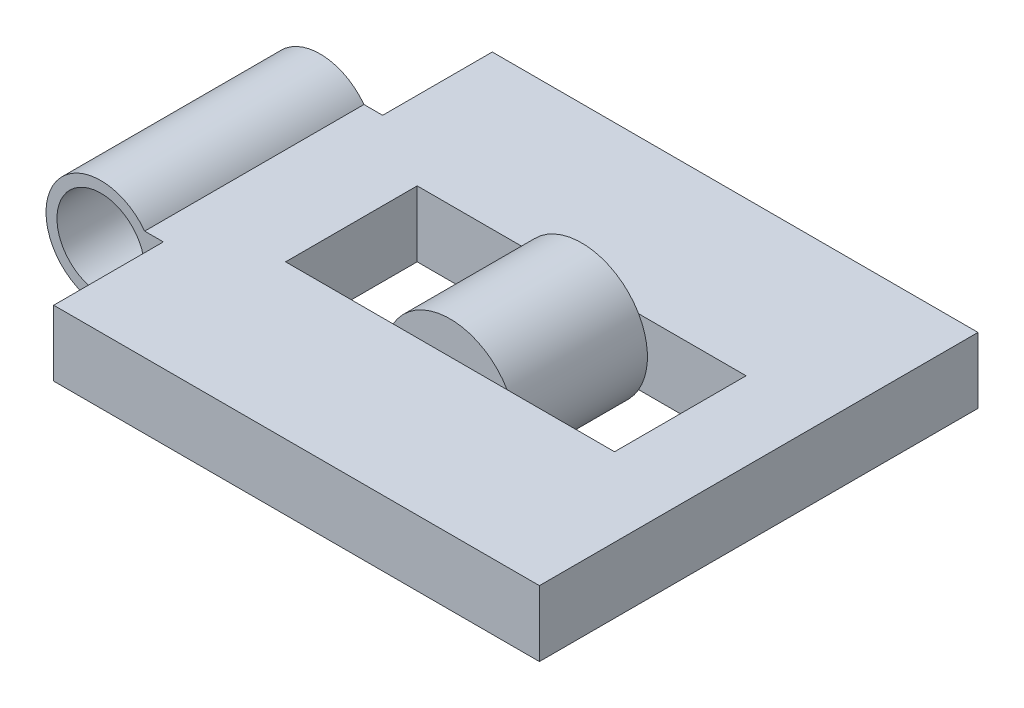
ISO-10303-21;
HEADER;
FILE_DESCRIPTION(('STEP AP214'),'2;1');
FILE_NAME('part.step','',(''),(''),'','','');
FILE_SCHEMA(('AUTOMOTIVE_DESIGN { 1 0 10303 214 1 1 1 1 }'));
ENDSEC;
DATA;
#1=APPLICATION_CONTEXT('core data for automotive mechanical design processes');
#2=APPLICATION_PROTOCOL_DEFINITION('international standard','automotive_design',2000,#1);
#3=PRODUCT_CONTEXT('',#1,'mechanical');
#4=PRODUCT('Part','Part','',(#3));
#5=PRODUCT_RELATED_PRODUCT_CATEGORY('part','',(#4));
#6=PRODUCT_DEFINITION_FORMATION('','',#4);
#7=PRODUCT_DEFINITION_CONTEXT('part definition',#1,'design');
#8=PRODUCT_DEFINITION('design','',#6,#7);
#9=PRODUCT_DEFINITION_SHAPE('','',#8);
#10=(LENGTH_UNIT() NAMED_UNIT(*) SI_UNIT(.MILLI.,.METRE.));
#11=(NAMED_UNIT(*) PLANE_ANGLE_UNIT() SI_UNIT($,.RADIAN.));
#12=(NAMED_UNIT(*) SI_UNIT($,.STERADIAN.) SOLID_ANGLE_UNIT());
#13=UNCERTAINTY_MEASURE_WITH_UNIT(LENGTH_MEASURE(1.E-05),#10,'distance_accuracy_value','');
#14=(GEOMETRIC_REPRESENTATION_CONTEXT(3) GLOBAL_UNCERTAINTY_ASSIGNED_CONTEXT((#13)) GLOBAL_UNIT_ASSIGNED_CONTEXT((#10,
#11,#12)) REPRESENTATION_CONTEXT('',''));
#15=CARTESIAN_POINT('',(0.,0.,0.));
#16=DIRECTION('',(0.,0.,1.));
#17=DIRECTION('',(1.,0.,0.));
#18=AXIS2_PLACEMENT_3D('',#15,#16,#17);
#19=CARTESIAN_POINT('',(108.842352038613,12.7,66.04));
#20=DIRECTION('',(0.,0.,1.));
#21=DIRECTION('',(1.,0.,0.));
#22=AXIS2_PLACEMENT_3D('',#19,#20,#21);
#23=PLANE('',#22);
#24=CARTESIAN_POINT('',(70.7423520386134,0.,66.04));
#25=DIRECTION('',(0.,0.,1.));
#26=DIRECTION('',(1.,0.,0.));
#27=AXIS2_PLACEMENT_3D('',#24,#25,#26);
#28=CIRCLE('',#27,15.24);
#29=CARTESIAN_POINT('',(57.5441248849386,7.62,66.04));
#30=VERTEX_POINT('',#29);
#31=CARTESIAN_POINT('',(57.5441248849386,-7.62,66.04));
#32=VERTEX_POINT('',#31);
#33=EDGE_CURVE('E452',#30,#32,#28,.T.);
#34=ORIENTED_EDGE('',*,*,#33,.T.);
#35=DIRECTION('',(-1.,0.,0.));
#36=VECTOR('',#35,1.);
#37=CARTESIAN_POINT('',(108.842352038613,-7.62,66.04));
#38=LINE('',#37,#36);
#39=CARTESIAN_POINT('',(32.6423520386134,-7.62,66.04));
#40=VERTEX_POINT('',#39);
#41=EDGE_CURVE('E461',#32,#40,#38,.T.);
#42=ORIENTED_EDGE('',*,*,#41,.T.);
#43=DIRECTION('',(0.,-1.,0.));
#44=VECTOR('',#43,1.);
#45=CARTESIAN_POINT('',(32.6423520386134,12.7,66.04));
#46=LINE('',#45,#44);
#47=CARTESIAN_POINT('',(32.6423520386134,7.62,66.04));
#48=VERTEX_POINT('',#47);
#49=EDGE_CURVE('E464',#48,#40,#46,.T.);
#50=ORIENTED_EDGE('',*,*,#49,.F.);
#51=DIRECTION('',(-1.,0.,0.));
#52=VECTOR('',#51,1.);
#53=CARTESIAN_POINT('',(0.,7.62,66.04));
#54=LINE('',#53,#52);
#55=EDGE_CURVE('E50',#30,#48,#54,.T.);
#56=ORIENTED_EDGE('',*,*,#55,.F.);
#57=EDGE_LOOP('',(#34,#42,#50,#56));
#58=FACE_BOUND('',#57,.T.);
#59=ADVANCED_FACE('F35',(#58),#23,.F.);
#60=CARTESIAN_POINT('',(108.842352038613,12.7,35.56));
#61=DIRECTION('',(0.,0.,-1.));
#62=DIRECTION('',(-1.,0.,0.));
#63=AXIS2_PLACEMENT_3D('',#60,#61,#62);
#64=PLANE('',#63);
#65=CARTESIAN_POINT('',(70.7423520386134,0.,35.56));
#66=DIRECTION('',(0.,0.,-1.));
#67=DIRECTION('',(-1.,0.,0.));
#68=AXIS2_PLACEMENT_3D('',#65,#66,#67);
#69=CIRCLE('',#68,15.24);
#70=CARTESIAN_POINT('',(83.9405791922882,-7.62,35.56));
#71=VERTEX_POINT('',#70);
#72=CARTESIAN_POINT('',(83.9405791922882,7.62,35.56));
#73=VERTEX_POINT('',#72);
#74=EDGE_CURVE('E11',#71,#73,#69,.F.);
#75=ORIENTED_EDGE('',*,*,#74,.F.);
#76=DIRECTION('',(1.,0.,0.));
#77=VECTOR('',#76,1.);
#78=CARTESIAN_POINT('',(108.842352038613,-7.62,35.56));
#79=LINE('',#78,#77);
#80=CARTESIAN_POINT('',(108.842352038613,-7.62,35.56));
#81=VERTEX_POINT('',#80);
#82=EDGE_CURVE('E160',#71,#81,#79,.T.);
#83=ORIENTED_EDGE('',*,*,#82,.T.);
#84=DIRECTION('',(0.,-1.,0.));
#85=VECTOR('',#84,1.);
#86=CARTESIAN_POINT('',(108.842352038613,12.7,35.56));
#87=LINE('',#86,#85);
#88=CARTESIAN_POINT('',(108.842352038613,7.62,35.56));
#89=VERTEX_POINT('',#88);
#90=EDGE_CURVE('E469',#89,#81,#87,.T.);
#91=ORIENTED_EDGE('',*,*,#90,.F.);
#92=DIRECTION('',(1.,0.,0.));
#93=VECTOR('',#92,1.);
#94=CARTESIAN_POINT('',(0.,7.62,35.56));
#95=LINE('',#94,#93);
#96=EDGE_CURVE('E466',#73,#89,#95,.T.);
#97=ORIENTED_EDGE('',*,*,#96,.F.);
#98=EDGE_LOOP('',(#75,#83,#91,#97));
#99=FACE_BOUND('',#98,.T.);
#100=ADVANCED_FACE('F297',(#99),#64,.F.);
#101=CARTESIAN_POINT('',(0.,7.62,101.6));
#102=DIRECTION('',(0.,-1.,0.));
#103=DIRECTION('',(0.,0.,-1.));
#104=AXIS2_PLACEMENT_3D('',#101,#102,#103);
#105=PLANE('',#104);
#106=CARTESIAN_POINT('',(108.842352038613,7.62,66.04));
#107=VERTEX_POINT('',#106);
#108=CARTESIAN_POINT('',(83.9405791922882,7.62,66.04));
#109=VERTEX_POINT('',#108);
#110=EDGE_CURVE('E478',#107,#109,#54,.T.);
#111=ORIENTED_EDGE('',*,*,#110,.T.);
#112=EDGE_CURVE('E479',#109,#30,#54,.T.);
#113=ORIENTED_EDGE('',*,*,#112,.T.);
#114=ORIENTED_EDGE('',*,*,#55,.T.);
#115=DIRECTION('',(0.,0.,-1.));
#116=VECTOR('',#115,1.);
#117=CARTESIAN_POINT('',(32.6423520386134,7.62,101.6));
#118=LINE('',#117,#116);
#119=CARTESIAN_POINT('',(32.6423520386134,7.62,35.56));
#120=VERTEX_POINT('',#119);
#121=EDGE_CURVE('E260',#48,#120,#118,.T.);
#122=ORIENTED_EDGE('',*,*,#121,.T.);
#123=CARTESIAN_POINT('',(57.5441248849386,7.62,35.56));
#124=VERTEX_POINT('',#123);
#125=EDGE_CURVE('E473',#120,#124,#95,.T.);
#126=ORIENTED_EDGE('',*,*,#125,.T.);
#127=EDGE_CURVE('E476',#124,#73,#95,.T.);
#128=ORIENTED_EDGE('',*,*,#127,.T.);
#129=ORIENTED_EDGE('',*,*,#96,.T.);
#130=DIRECTION('',(0.,0.,1.));
#131=VECTOR('',#130,1.);
#132=CARTESIAN_POINT('',(108.842352038613,7.62,101.6));
#133=LINE('',#132,#131);
#134=EDGE_CURVE('E475',#89,#107,#133,.T.);
#135=ORIENTED_EDGE('',*,*,#134,.T.);
#136=EDGE_LOOP('',(#111,#113,#114,#122,#126,#128,#129,#135));
#137=FACE_BOUND('',#136,.T.);
#138=DIRECTION('',(0.,0.,-1.));
#139=VECTOR('',#138,1.);
#140=CARTESIAN_POINT('',(14.4847040772268,7.62,101.6));
#141=LINE('',#140,#139);
#142=CARTESIAN_POINT('',(14.4847040772268,7.62,25.4));
#143=VERTEX_POINT('',#142);
#144=CARTESIAN_POINT('',(14.4847040772268,7.62,0.));
#145=VERTEX_POINT('',#144);
#146=EDGE_CURVE('E245',#143,#145,#141,.T.);
#147=ORIENTED_EDGE('',*,*,#146,.F.);
#148=DIRECTION('',(-1.,0.,0.));
#149=VECTOR('',#148,1.);
#150=CARTESIAN_POINT('',(0.,7.62,25.4));
#151=LINE('',#150,#149);
#152=CARTESIAN_POINT('',(10.16,7.62,25.4));
#153=VERTEX_POINT('',#152);
#154=EDGE_CURVE('E211',#143,#153,#151,.T.);
#155=ORIENTED_EDGE('',*,*,#154,.T.);
#156=DIRECTION('',(0.,0.,-1.));
#157=VECTOR('',#156,1.);
#158=CARTESIAN_POINT('',(10.16,7.62,101.6));
#159=LINE('',#158,#157);
#160=CARTESIAN_POINT('',(10.16,7.62,76.2));
#161=VERTEX_POINT('',#160);
#162=EDGE_CURVE('E184',#161,#153,#159,.T.);
#163=ORIENTED_EDGE('',*,*,#162,.F.);
#164=DIRECTION('',(-1.,0.,0.));
#165=VECTOR('',#164,1.);
#166=CARTESIAN_POINT('',(0.,7.62,76.2));
#167=LINE('',#166,#165);
#168=CARTESIAN_POINT('',(14.4847040772268,7.62,76.2));
#169=VERTEX_POINT('',#168);
#170=EDGE_CURVE('E195',#169,#161,#167,.T.);
#171=ORIENTED_EDGE('',*,*,#170,.F.);
#172=DIRECTION('',(0.,0.,1.));
#173=VECTOR('',#172,1.);
#174=CARTESIAN_POINT('',(14.4847040772268,7.62,101.6));
#175=LINE('',#174,#173);
#176=CARTESIAN_POINT('',(14.4847040772268,7.62,101.6));
#177=VERTEX_POINT('',#176);
#178=EDGE_CURVE('E191',#169,#177,#175,.T.);
#179=ORIENTED_EDGE('',*,*,#178,.T.);
#180=DIRECTION('',(-1.,0.,0.));
#181=VECTOR('',#180,1.);
#182=CARTESIAN_POINT('',(0.,7.62,101.6));
#183=LINE('',#182,#181);
#184=CARTESIAN_POINT('',(127.,7.62,101.6));
#185=VERTEX_POINT('',#184);
#186=EDGE_CURVE('E215',#185,#177,#183,.T.);
#187=ORIENTED_EDGE('',*,*,#186,.F.);
#188=DIRECTION('',(0.,0.,-1.));
#189=VECTOR('',#188,1.);
#190=CARTESIAN_POINT('',(127.,7.62,101.6));
#191=LINE('',#190,#189);
#192=CARTESIAN_POINT('',(127.,7.62,0.));
#193=VERTEX_POINT('',#192);
#194=EDGE_CURVE('E224',#185,#193,#191,.T.);
#195=ORIENTED_EDGE('',*,*,#194,.T.);
#196=DIRECTION('',(-1.,0.,0.));
#197=VECTOR('',#196,1.);
#198=CARTESIAN_POINT('',(0.,7.62,0.));
#199=LINE('',#198,#197);
#200=EDGE_CURVE('E214',#193,#145,#199,.T.);
#201=ORIENTED_EDGE('',*,*,#200,.T.);
#202=EDGE_LOOP('',(#147,#155,#163,#171,#179,#187,#195,#201));
#203=FACE_BOUND('',#202,.T.);
#204=ADVANCED_FACE('F244',(#137,#203),#105,.F.);
#205=CARTESIAN_POINT('',(0.,0.,101.6));
#206=DIRECTION('',(0.,0.,-1.));
#207=DIRECTION('',(-1.,0.,0.));
#208=AXIS2_PLACEMENT_3D('',#205,#206,#207);
#209=CYLINDRICAL_SURFACE('',#208,12.7);
#210=CARTESIAN_POINT('',(0.,0.,25.4));
#211=DIRECTION('',(0.,0.,1.));
#212=DIRECTION('',(1.,0.,0.));
#213=AXIS2_PLACEMENT_3D('',#210,#211,#212);
#214=CIRCLE('',#213,12.7);
#215=CARTESIAN_POINT('',(10.16,-7.62,25.4));
#216=VERTEX_POINT('',#215);
#217=EDGE_CURVE('E199',#153,#216,#214,.T.);
#218=ORIENTED_EDGE('',*,*,#217,.T.);
#219=DIRECTION('',(0.,0.,-1.));
#220=VECTOR('',#219,1.);
#221=CARTESIAN_POINT('',(10.16,-7.62,101.6));
#222=LINE('',#221,#220);
#223=CARTESIAN_POINT('',(10.16,-7.62,76.2));
#224=VERTEX_POINT('',#223);
#225=EDGE_CURVE('E235',#224,#216,#222,.T.);
#226=ORIENTED_EDGE('',*,*,#225,.F.);
#227=CARTESIAN_POINT('',(0.,0.,76.2));
#228=DIRECTION('',(0.,0.,1.));
#229=DIRECTION('',(1.,0.,0.));
#230=AXIS2_PLACEMENT_3D('',#227,#228,#229);
#231=CIRCLE('',#230,12.7);
#232=EDGE_CURVE('E201',#161,#224,#231,.T.);
#233=ORIENTED_EDGE('',*,*,#232,.F.);
#234=ORIENTED_EDGE('',*,*,#162,.T.);
#235=EDGE_LOOP('',(#218,#226,#233,#234));
#236=FACE_BOUND('',#235,.T.);
#237=ADVANCED_FACE('F240',(#236),#209,.T.);
#238=CARTESIAN_POINT('',(0.,-7.62,101.6));
#239=DIRECTION('',(0.,-1.,0.));
#240=DIRECTION('',(0.,0.,-1.));
#241=AXIS2_PLACEMENT_3D('',#238,#239,#240);
#242=PLANE('',#241);
#243=DIRECTION('',(0.,0.,-1.));
#244=VECTOR('',#243,1.);
#245=CARTESIAN_POINT('',(32.6423520386134,-7.62,35.56));
#246=LINE('',#245,#244);
#247=CARTESIAN_POINT('',(32.6423520386134,-7.62,35.56));
#248=VERTEX_POINT('',#247);
#249=EDGE_CURVE('E457',#40,#248,#246,.T.);
#250=ORIENTED_EDGE('',*,*,#249,.F.);
#251=ORIENTED_EDGE('',*,*,#41,.F.);
#252=CARTESIAN_POINT('',(83.9405791922882,-7.62,66.04));
#253=VERTEX_POINT('',#252);
#254=EDGE_CURVE('E450',#253,#32,#38,.T.);
#255=ORIENTED_EDGE('',*,*,#254,.F.);
#256=CARTESIAN_POINT('',(108.842352038613,-7.62,66.04));
#257=VERTEX_POINT('',#256);
#258=EDGE_CURVE('E462',#257,#253,#38,.T.);
#259=ORIENTED_EDGE('',*,*,#258,.F.);
#260=DIRECTION('',(0.,0.,1.));
#261=VECTOR('',#260,1.);
#262=CARTESIAN_POINT('',(108.842352038613,-7.62,35.56));
#263=LINE('',#262,#261);
#264=EDGE_CURVE('E157',#81,#257,#263,.T.);
#265=ORIENTED_EDGE('',*,*,#264,.F.);
#266=ORIENTED_EDGE('',*,*,#82,.F.);
#267=CARTESIAN_POINT('',(57.5441248849386,-7.62,35.56));
#268=VERTEX_POINT('',#267);
#269=EDGE_CURVE('E158',#268,#71,#79,.T.);
#270=ORIENTED_EDGE('',*,*,#269,.F.);
#271=EDGE_CURVE('E148',#248,#268,#79,.T.);
#272=ORIENTED_EDGE('',*,*,#271,.F.);
#273=EDGE_LOOP('',(#250,#251,#255,#259,#265,#266,#270,#272));
#274=FACE_BOUND('',#273,.T.);
#275=DIRECTION('',(-1.,0.,0.));
#276=VECTOR('',#275,1.);
#277=CARTESIAN_POINT('',(0.,-7.62,25.4));
#278=LINE('',#277,#276);
#279=CARTESIAN_POINT('',(14.4847040772268,-7.62,25.4));
#280=VERTEX_POINT('',#279);
#281=EDGE_CURVE('E194',#280,#216,#278,.T.);
#282=ORIENTED_EDGE('',*,*,#281,.F.);
#283=DIRECTION('',(0.,0.,-1.));
#284=VECTOR('',#283,1.);
#285=CARTESIAN_POINT('',(14.4847040772268,-7.62,101.6));
#286=LINE('',#285,#284);
#287=CARTESIAN_POINT('',(14.4847040772268,-7.62,0.));
#288=VERTEX_POINT('',#287);
#289=EDGE_CURVE('E256',#280,#288,#286,.T.);
#290=ORIENTED_EDGE('',*,*,#289,.T.);
#291=DIRECTION('',(-1.,0.,0.));
#292=VECTOR('',#291,1.);
#293=CARTESIAN_POINT('',(0.,-7.62,0.));
#294=LINE('',#293,#292);
#295=CARTESIAN_POINT('',(127.,-7.62,0.));
#296=VERTEX_POINT('',#295);
#297=EDGE_CURVE('E227',#296,#288,#294,.T.);
#298=ORIENTED_EDGE('',*,*,#297,.F.);
#299=DIRECTION('',(0.,0.,-1.));
#300=VECTOR('',#299,1.);
#301=CARTESIAN_POINT('',(127.,-7.62,101.6));
#302=LINE('',#301,#300);
#303=CARTESIAN_POINT('',(127.,-7.62,101.6));
#304=VERTEX_POINT('',#303);
#305=EDGE_CURVE('E233',#304,#296,#302,.T.);
#306=ORIENTED_EDGE('',*,*,#305,.F.);
#307=DIRECTION('',(-1.,0.,0.));
#308=VECTOR('',#307,1.);
#309=CARTESIAN_POINT('',(0.,-7.62,101.6));
#310=LINE('',#309,#308);
#311=CARTESIAN_POINT('',(14.4847040772268,-7.62,101.6));
#312=VERTEX_POINT('',#311);
#313=EDGE_CURVE('E218',#304,#312,#310,.T.);
#314=ORIENTED_EDGE('',*,*,#313,.T.);
#315=DIRECTION('',(0.,0.,1.));
#316=VECTOR('',#315,1.);
#317=CARTESIAN_POINT('',(14.4847040772268,-7.62,101.6));
#318=LINE('',#317,#316);
#319=CARTESIAN_POINT('',(14.4847040772268,-7.62,76.2));
#320=VERTEX_POINT('',#319);
#321=EDGE_CURVE('E266',#320,#312,#318,.T.);
#322=ORIENTED_EDGE('',*,*,#321,.F.);
#323=DIRECTION('',(-1.,0.,0.));
#324=VECTOR('',#323,1.);
#325=CARTESIAN_POINT('',(0.,-7.62,76.2));
#326=LINE('',#325,#324);
#327=EDGE_CURVE('E190',#320,#224,#326,.T.);
#328=ORIENTED_EDGE('',*,*,#327,.T.);
#329=ORIENTED_EDGE('',*,*,#225,.T.);
#330=EDGE_LOOP('',(#282,#290,#298,#306,#314,#322,#328,#329));
#331=FACE_BOUND('',#330,.T.);
#332=ADVANCED_FACE('F164',(#274,#331),#242,.T.);
#333=CARTESIAN_POINT('',(0.,0.,0.));
#334=DIRECTION('',(0.,0.,1.));
#335=DIRECTION('',(1.,0.,0.));
#336=AXIS2_PLACEMENT_3D('',#333,#334,#335);
#337=PLANE('',#336);
#338=DIRECTION('',(0.,-1.,0.));
#339=VECTOR('',#338,1.);
#340=CARTESIAN_POINT('',(14.4847040772268,0.,0.));
#341=LINE('',#340,#339);
#342=EDGE_CURVE('E179',#145,#288,#341,.T.);
#343=ORIENTED_EDGE('',*,*,#342,.F.);
#344=ORIENTED_EDGE('',*,*,#200,.F.);
#345=DIRECTION('',(0.,1.,0.));
#346=VECTOR('',#345,1.);
#347=CARTESIAN_POINT('',(127.,0.,0.));
#348=LINE('',#347,#346);
#349=EDGE_CURVE('E219',#296,#193,#348,.T.);
#350=ORIENTED_EDGE('',*,*,#349,.F.);
#351=ORIENTED_EDGE('',*,*,#297,.T.);
#352=EDGE_LOOP('',(#343,#344,#350,#351));
#353=FACE_BOUND('',#352,.T.);
#354=ADVANCED_FACE('F284',(#353),#337,.F.);
#355=CARTESIAN_POINT('',(127.,0.,101.6));
#356=DIRECTION('',(-1.,0.,0.));
#357=DIRECTION('',(0.,0.,1.));
#358=AXIS2_PLACEMENT_3D('',#355,#356,#357);
#359=PLANE('',#358);
#360=ORIENTED_EDGE('',*,*,#349,.T.);
#361=ORIENTED_EDGE('',*,*,#194,.F.);
#362=DIRECTION('',(0.,1.,0.));
#363=VECTOR('',#362,1.);
#364=CARTESIAN_POINT('',(127.,0.,101.6));
#365=LINE('',#364,#363);
#366=EDGE_CURVE('E222',#304,#185,#365,.T.);
#367=ORIENTED_EDGE('',*,*,#366,.F.);
#368=ORIENTED_EDGE('',*,*,#305,.T.);
#369=EDGE_LOOP('',(#360,#361,#367,#368));
#370=FACE_BOUND('',#369,.T.);
#371=ADVANCED_FACE('F280',(#370),#359,.F.);
#372=CARTESIAN_POINT('',(0.,0.,101.6));
#373=DIRECTION('',(0.,0.,1.));
#374=DIRECTION('',(1.,0.,0.));
#375=AXIS2_PLACEMENT_3D('',#372,#373,#374);
#376=PLANE('',#375);
#377=DIRECTION('',(0.,1.,0.));
#378=VECTOR('',#377,1.);
#379=CARTESIAN_POINT('',(14.4847040772268,0.,101.6));
#380=LINE('',#379,#378);
#381=EDGE_CURVE('E178',#312,#177,#380,.T.);
#382=ORIENTED_EDGE('',*,*,#381,.F.);
#383=ORIENTED_EDGE('',*,*,#313,.F.);
#384=ORIENTED_EDGE('',*,*,#366,.T.);
#385=ORIENTED_EDGE('',*,*,#186,.T.);
#386=EDGE_LOOP('',(#382,#383,#384,#385));
#387=FACE_BOUND('',#386,.T.);
#388=ADVANCED_FACE('F275',(#387),#376,.T.);
#389=CARTESIAN_POINT('',(-12.7,-12.7,25.4));
#390=DIRECTION('',(0.,0.,1.));
#391=DIRECTION('',(1.,0.,0.));
#392=AXIS2_PLACEMENT_3D('',#389,#390,#391);
#393=PLANE('',#392);
#394=CARTESIAN_POINT('',(0.,0.,25.4));
#395=DIRECTION('',(0.,0.,1.));
#396=DIRECTION('',(1.,0.,0.));
#397=AXIS2_PLACEMENT_3D('',#394,#395,#396);
#398=CIRCLE('',#397,10.16);
#399=CARTESIAN_POINT('',(10.16,0.,25.4));
#400=VERTEX_POINT('',#399);
#401=EDGE_CURVE('E192',#400,#400,#398,.T.);
#402=ORIENTED_EDGE('',*,*,#401,.T.);
#403=EDGE_LOOP('',(#402));
#404=FACE_BOUND('',#403,.T.);
#405=DIRECTION('',(0.,1.,0.));
#406=VECTOR('',#405,1.);
#407=CARTESIAN_POINT('',(14.4847040772268,-12.7,25.4));
#408=LINE('',#407,#406);
#409=EDGE_CURVE('E250',#280,#143,#408,.T.);
#410=ORIENTED_EDGE('',*,*,#409,.F.);
#411=ORIENTED_EDGE('',*,*,#281,.T.);
#412=ORIENTED_EDGE('',*,*,#217,.F.);
#413=ORIENTED_EDGE('',*,*,#154,.F.);
#414=EDGE_LOOP('',(#410,#411,#412,#413));
#415=FACE_BOUND('',#414,.T.);
#416=ADVANCED_FACE('F249',(#404,#415),#393,.F.);
#417=CARTESIAN_POINT('',(14.4847040772268,-12.7,0.));
#418=DIRECTION('',(-1.,0.,0.));
#419=DIRECTION('',(0.,0.,1.));
#420=AXIS2_PLACEMENT_3D('',#417,#418,#419);
#421=PLANE('',#420);
#422=ORIENTED_EDGE('',*,*,#146,.T.);
#423=ORIENTED_EDGE('',*,*,#342,.T.);
#424=ORIENTED_EDGE('',*,*,#289,.F.);
#425=ORIENTED_EDGE('',*,*,#409,.T.);
#426=EDGE_LOOP('',(#422,#423,#424,#425));
#427=FACE_BOUND('',#426,.T.);
#428=ADVANCED_FACE('F253',(#427),#421,.T.);
#429=CARTESIAN_POINT('',(-12.7,-12.7,76.2));
#430=DIRECTION('',(0.,0.,1.));
#431=DIRECTION('',(1.,0.,0.));
#432=AXIS2_PLACEMENT_3D('',#429,#430,#431);
#433=PLANE('',#432);
#434=CARTESIAN_POINT('',(0.,0.,76.2));
#435=DIRECTION('',(0.,0.,1.));
#436=DIRECTION('',(1.,0.,0.));
#437=AXIS2_PLACEMENT_3D('',#434,#435,#436);
#438=CIRCLE('',#437,10.16);
#439=CARTESIAN_POINT('',(10.16,0.,76.2));
#440=VERTEX_POINT('',#439);
#441=EDGE_CURVE('E188',#440,#440,#438,.T.);
#442=ORIENTED_EDGE('',*,*,#441,.F.);
#443=EDGE_LOOP('',(#442));
#444=FACE_BOUND('',#443,.T.);
#445=ORIENTED_EDGE('',*,*,#170,.T.);
#446=ORIENTED_EDGE('',*,*,#232,.T.);
#447=ORIENTED_EDGE('',*,*,#327,.F.);
#448=DIRECTION('',(0.,1.,0.));
#449=VECTOR('',#448,1.);
#450=CARTESIAN_POINT('',(14.4847040772268,-12.7,76.2));
#451=LINE('',#450,#449);
#452=EDGE_CURVE('E257',#320,#169,#451,.T.);
#453=ORIENTED_EDGE('',*,*,#452,.T.);
#454=EDGE_LOOP('',(#445,#446,#447,#453));
#455=FACE_BOUND('',#454,.T.);
#456=ADVANCED_FACE('F271',(#444,#455),#433,.T.);
#457=CARTESIAN_POINT('',(14.4847040772268,-12.7,101.6));
#458=DIRECTION('',(1.,0.,0.));
#459=DIRECTION('',(0.,0.,-1.));
#460=AXIS2_PLACEMENT_3D('',#457,#458,#459);
#461=PLANE('',#460);
#462=ORIENTED_EDGE('',*,*,#452,.F.);
#463=ORIENTED_EDGE('',*,*,#321,.T.);
#464=ORIENTED_EDGE('',*,*,#381,.T.);
#465=ORIENTED_EDGE('',*,*,#178,.F.);
#466=EDGE_LOOP('',(#462,#463,#464,#465));
#467=FACE_BOUND('',#466,.T.);
#468=ADVANCED_FACE('F272',(#467),#461,.F.);
#469=CARTESIAN_POINT('',(0.,0.,101.6));
#470=DIRECTION('',(0.,0.,-1.));
#471=DIRECTION('',(-1.,0.,0.));
#472=AXIS2_PLACEMENT_3D('',#469,#470,#471);
#473=CYLINDRICAL_SURFACE('',#472,10.16);
#474=ORIENTED_EDGE('',*,*,#401,.F.);
#475=EDGE_LOOP('',(#474));
#476=FACE_BOUND('',#475,.T.);
#477=ORIENTED_EDGE('',*,*,#441,.T.);
#478=EDGE_LOOP('',(#477));
#479=FACE_BOUND('',#478,.T.);
#480=ADVANCED_FACE('F37',(#476,#479),#473,.F.);
#481=CARTESIAN_POINT('',(32.6423520386134,12.7,35.56));
#482=DIRECTION('',(-1.,0.,0.));
#483=DIRECTION('',(0.,0.,1.));
#484=AXIS2_PLACEMENT_3D('',#481,#482,#483);
#485=PLANE('',#484);
#486=ORIENTED_EDGE('',*,*,#49,.T.);
#487=ORIENTED_EDGE('',*,*,#249,.T.);
#488=DIRECTION('',(0.,-1.,0.));
#489=VECTOR('',#488,1.);
#490=CARTESIAN_POINT('',(32.6423520386134,12.7,35.56));
#491=LINE('',#490,#489);
#492=EDGE_CURVE('E154',#120,#248,#491,.T.);
#493=ORIENTED_EDGE('',*,*,#492,.F.);
#494=ORIENTED_EDGE('',*,*,#121,.F.);
#495=EDGE_LOOP('',(#486,#487,#493,#494));
#496=FACE_BOUND('',#495,.T.);
#497=ADVANCED_FACE('F310',(#496),#485,.F.);
#498=EDGE_CURVE('E58',#253,#109,#28,.T.);
#499=ORIENTED_EDGE('',*,*,#498,.T.);
#500=ORIENTED_EDGE('',*,*,#110,.F.);
#501=DIRECTION('',(0.,-1.,0.));
#502=VECTOR('',#501,1.);
#503=CARTESIAN_POINT('',(108.842352038613,12.7,66.04));
#504=LINE('',#503,#502);
#505=EDGE_CURVE('E467',#107,#257,#504,.T.);
#506=ORIENTED_EDGE('',*,*,#505,.T.);
#507=ORIENTED_EDGE('',*,*,#258,.T.);
#508=EDGE_LOOP('',(#499,#500,#506,#507));
#509=FACE_BOUND('',#508,.T.);
#510=ADVANCED_FACE('F299',(#509),#23,.F.);
#511=CARTESIAN_POINT('',(108.842352038613,12.7,35.56));
#512=DIRECTION('',(1.,0.,0.));
#513=DIRECTION('',(0.,0.,-1.));
#514=AXIS2_PLACEMENT_3D('',#511,#512,#513);
#515=PLANE('',#514);
#516=ORIENTED_EDGE('',*,*,#90,.T.);
#517=ORIENTED_EDGE('',*,*,#264,.T.);
#518=ORIENTED_EDGE('',*,*,#505,.F.);
#519=ORIENTED_EDGE('',*,*,#134,.F.);
#520=EDGE_LOOP('',(#516,#517,#518,#519));
#521=FACE_BOUND('',#520,.T.);
#522=ADVANCED_FACE('F309',(#521),#515,.F.);
#523=EDGE_CURVE('E39',#124,#268,#69,.F.);
#524=ORIENTED_EDGE('',*,*,#523,.F.);
#525=ORIENTED_EDGE('',*,*,#125,.F.);
#526=ORIENTED_EDGE('',*,*,#492,.T.);
#527=ORIENTED_EDGE('',*,*,#271,.T.);
#528=EDGE_LOOP('',(#524,#525,#526,#527));
#529=FACE_BOUND('',#528,.T.);
#530=ADVANCED_FACE('F150',(#529),#64,.F.);
#531=CARTESIAN_POINT('',(70.7423520386134,0.,35.56));
#532=DIRECTION('',(0.,0.,1.));
#533=DIRECTION('',(1.,0.,0.));
#534=AXIS2_PLACEMENT_3D('',#531,#532,#533);
#535=PLANE('',#534);
#536=CARTESIAN_POINT('',(70.7423520386134,0.,35.56));
#537=DIRECTION('',(0.,0.,1.));
#538=DIRECTION('',(1.,0.,0.));
#539=AXIS2_PLACEMENT_3D('',#536,#537,#538);
#540=CIRCLE('',#539,15.24);
#541=EDGE_CURVE('E172',#73,#124,#540,.T.);
#542=ORIENTED_EDGE('',*,*,#541,.F.);
#543=ORIENTED_EDGE('',*,*,#127,.F.);
#544=EDGE_LOOP('',(#542,#543));
#545=FACE_BOUND('',#544,.T.);
#546=ADVANCED_FACE('F401',(#545),#535,.F.);
#547=CARTESIAN_POINT('',(108.842352038613,12.7,66.04));
#548=DIRECTION('',(0.,0.,1.));
#549=DIRECTION('',(1.,0.,0.));
#550=AXIS2_PLACEMENT_3D('',#547,#548,#549);
#551=PLANE('',#550);
#552=ORIENTED_EDGE('',*,*,#112,.F.);
#553=EDGE_CURVE('E454',#109,#30,#28,.T.);
#554=ORIENTED_EDGE('',*,*,#553,.T.);
#555=EDGE_LOOP('',(#552,#554));
#556=FACE_BOUND('',#555,.T.);
#557=ADVANCED_FACE('F408',(#556),#551,.T.);
#558=CARTESIAN_POINT('',(70.7423520386134,0.,109.145229381132));
#559=DIRECTION('',(0.,0.,-1.));
#560=DIRECTION('',(-1.,0.,0.));
#561=AXIS2_PLACEMENT_3D('',#558,#559,#560);
#562=CYLINDRICAL_SURFACE('',#561,15.24);
#563=ORIENTED_EDGE('',*,*,#541,.T.);
#564=ORIENTED_EDGE('',*,*,#523,.T.);
#565=EDGE_CURVE('E169',#268,#71,#540,.T.);
#566=ORIENTED_EDGE('',*,*,#565,.T.);
#567=ORIENTED_EDGE('',*,*,#74,.T.);
#568=EDGE_LOOP('',(#563,#564,#566,#567));
#569=FACE_BOUND('',#568,.T.);
#570=ORIENTED_EDGE('',*,*,#553,.F.);
#571=ORIENTED_EDGE('',*,*,#498,.F.);
#572=EDGE_CURVE('E448',#32,#253,#28,.T.);
#573=ORIENTED_EDGE('',*,*,#572,.F.);
#574=ORIENTED_EDGE('',*,*,#33,.F.);
#575=EDGE_LOOP('',(#570,#571,#573,#574));
#576=FACE_BOUND('',#575,.T.);
#577=ADVANCED_FACE('F175',(#569,#576),#562,.T.);
#578=ORIENTED_EDGE('',*,*,#269,.T.);
#579=ORIENTED_EDGE('',*,*,#565,.F.);
#580=EDGE_LOOP('',(#578,#579));
#581=FACE_BOUND('',#580,.T.);
#582=ADVANCED_FACE('F170',(#581),#535,.F.);
#583=ORIENTED_EDGE('',*,*,#572,.T.);
#584=ORIENTED_EDGE('',*,*,#254,.T.);
#585=EDGE_LOOP('',(#583,#584));
#586=FACE_BOUND('',#585,.T.);
#587=ADVANCED_FACE('F419',(#586),#551,.T.);
#588=CLOSED_SHELL('',(#59,#100,#204,#237,#332,#354,#371,#388,#416,#428,#456,#468,#480,#497,#510,
#522,#530,#546,#557,#577,#582,#587));
#589=MANIFOLD_SOLID_BREP('B2',#588);
#590=ADVANCED_BREP_SHAPE_REPRESENTATION('',(#18,#589),#14);
#591=SHAPE_DEFINITION_REPRESENTATION(#9,#590);
ENDSEC;
END-ISO-10303-21;
